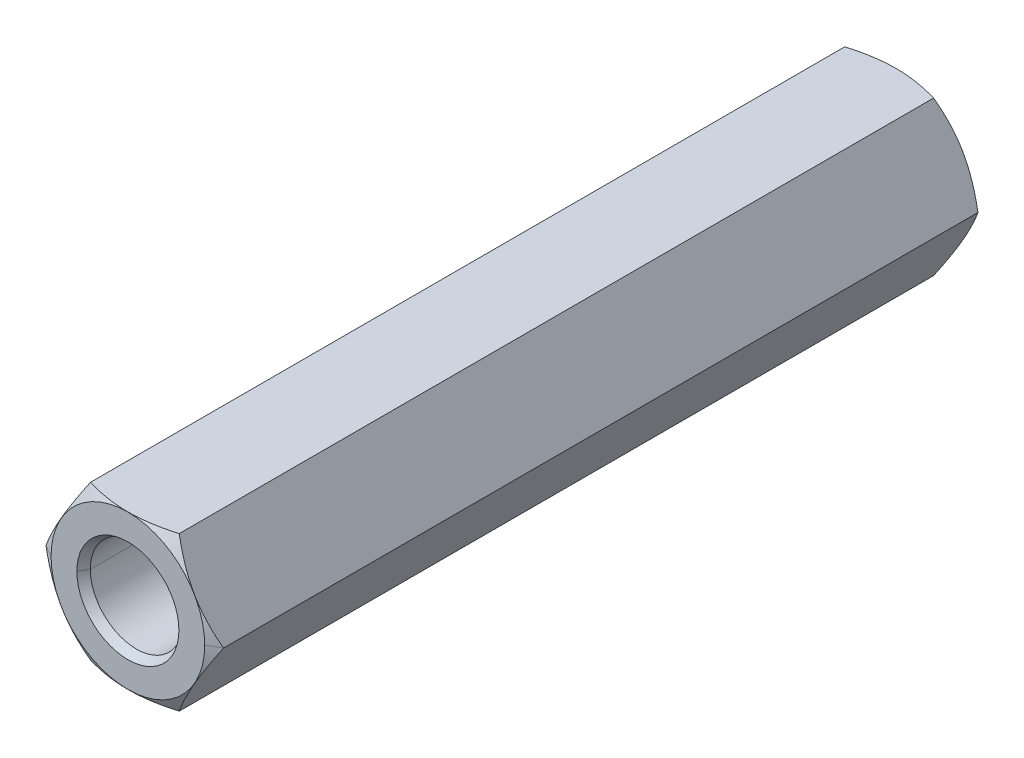
ISO-10303-21;
HEADER;
FILE_DESCRIPTION(('STEP AP214'),'2;1');
FILE_NAME('part.step','',(''),(''),'','','');
FILE_SCHEMA(('AUTOMOTIVE_DESIGN { 1 0 10303 214 1 1 1 1 }'));
ENDSEC;
DATA;
#1=APPLICATION_CONTEXT('core data for automotive mechanical design processes');
#2=APPLICATION_PROTOCOL_DEFINITION('international standard','automotive_design',2000,#1);
#3=PRODUCT_CONTEXT('',#1,'mechanical');
#4=PRODUCT('Part','Part','',(#3));
#5=PRODUCT_RELATED_PRODUCT_CATEGORY('part','',(#4));
#6=PRODUCT_DEFINITION_FORMATION('','',#4);
#7=PRODUCT_DEFINITION_CONTEXT('part definition',#1,'design');
#8=PRODUCT_DEFINITION('design','',#6,#7);
#9=PRODUCT_DEFINITION_SHAPE('','',#8);
#10=(LENGTH_UNIT() NAMED_UNIT(*) SI_UNIT(.MILLI.,.METRE.));
#11=(NAMED_UNIT(*) PLANE_ANGLE_UNIT() SI_UNIT($,.RADIAN.));
#12=(NAMED_UNIT(*) SI_UNIT($,.STERADIAN.) SOLID_ANGLE_UNIT());
#13=UNCERTAINTY_MEASURE_WITH_UNIT(LENGTH_MEASURE(1.E-05),#10,'distance_accuracy_value','');
#14=(GEOMETRIC_REPRESENTATION_CONTEXT(3) GLOBAL_UNCERTAINTY_ASSIGNED_CONTEXT((#13)) GLOBAL_UNIT_ASSIGNED_CONTEXT((#10,
#11,#12)) REPRESENTATION_CONTEXT('',''));
#15=CARTESIAN_POINT('',(0.,0.,0.));
#16=DIRECTION('',(0.,0.,1.));
#17=DIRECTION('',(1.,0.,0.));
#18=AXIS2_PLACEMENT_3D('',#15,#16,#17);
#19=CARTESIAN_POINT('',(220.318744279938,82.5620432923505,90.4476083123826));
#20=DIRECTION('',(0.,0.,-1.));
#21=DIRECTION('',(1.,0.,0.));
#22=AXIS2_PLACEMENT_3D('',#19,#20,#21);
#23=CONICAL_SURFACE('',#22,1.7320508075705,1.047197551197);
#24=DIRECTION('',(0.86602540378464,0.,-0.499999999999652));
#25=VECTOR('',#24,1.);
#26=CARTESIAN_POINT('',(222.050795087508,82.5620432923505,90.4476083123826));
#27=LINE('',#26,#25);
#28=CARTESIAN_POINT('',(220.318744279938,82.5620432923505,91.4476083123826));
#29=VERTEX_POINT('',#28);
#30=CARTESIAN_POINT('',(221.818744279938,82.5620432923505,90.5815829085986));
#31=VERTEX_POINT('',#30);
#32=EDGE_CURVE('E69',#29,#31,#27,.T.);
#33=ORIENTED_EDGE('',*,*,#32,.F.);
#34=DIRECTION('',(-0.86602540378464,0.,-0.499999999999652));
#35=VECTOR('',#34,1.);
#36=CARTESIAN_POINT('',(218.586693472367,82.5620432923505,90.4476083123826));
#37=LINE('',#36,#35);
#38=CARTESIAN_POINT('',(218.818744279938,82.5620432923505,90.5815829085986));
#39=VERTEX_POINT('',#38);
#40=EDGE_CURVE('E11',#29,#39,#37,.T.);
#41=ORIENTED_EDGE('',*,*,#40,.T.);
#42=CARTESIAN_POINT('',(220.318744279938,82.5620432923505,90.5815829085986));
#43=DIRECTION('',(0.,0.,1.));
#44=DIRECTION('',(1.,0.,0.));
#45=AXIS2_PLACEMENT_3D('',#42,#43,#44);
#46=CIRCLE('',#45,1.5);
#47=EDGE_CURVE('E57',#31,#39,#46,.T.);
#48=ORIENTED_EDGE('',*,*,#47,.F.);
#49=EDGE_LOOP('',(#33,#41,#48));
#50=FACE_BOUND('',#49,.T.);
#51=ADVANCED_FACE('F44',(#50),#23,.F.);
#52=CARTESIAN_POINT('',(220.318744279938,82.5620432923505,90.5815829085986));
#53=DIRECTION('',(0.,0.,-1.));
#54=DIRECTION('',(1.,0.,0.));
#55=AXIS2_PLACEMENT_3D('',#52,#53,#54);
#56=CYLINDRICAL_SURFACE('',#55,1.5);
#57=ORIENTED_EDGE('',*,*,#47,.T.);
#58=DIRECTION('',(0.,0.,-1.));
#59=VECTOR('',#58,1.);
#60=CARTESIAN_POINT('',(218.818744279938,82.5620432923505,90.5815829085986));
#61=LINE('',#60,#59);
#62=CARTESIAN_POINT('',(218.818744279938,82.5620432923505,80.8587110378087));
#63=VERTEX_POINT('',#62);
#64=EDGE_CURVE('E278',#39,#63,#61,.T.);
#65=ORIENTED_EDGE('',*,*,#64,.T.);
#66=CARTESIAN_POINT('',(220.318744279938,82.5620432923505,80.8587110378087));
#67=DIRECTION('',(0.,0.,1.));
#68=DIRECTION('',(1.,0.,0.));
#69=AXIS2_PLACEMENT_3D('',#66,#67,#68);
#70=CIRCLE('',#69,1.5);
#71=CARTESIAN_POINT('',(221.818744279938,82.5620432923505,80.8587110378087));
#72=VERTEX_POINT('',#71);
#73=EDGE_CURVE('E282',#72,#63,#70,.T.);
#74=ORIENTED_EDGE('',*,*,#73,.F.);
#75=DIRECTION('',(0.,0.,-1.));
#76=VECTOR('',#75,1.);
#77=CARTESIAN_POINT('',(221.818744279938,82.5620432923505,90.5815829085986));
#78=LINE('',#77,#76);
#79=EDGE_CURVE('E268',#31,#72,#78,.T.);
#80=ORIENTED_EDGE('',*,*,#79,.F.);
#81=EDGE_LOOP('',(#57,#65,#74,#80));
#82=FACE_BOUND('',#81,.T.);
#83=ADVANCED_FACE('F392',(#82),#56,.F.);
#84=CARTESIAN_POINT('',(220.318744279938,82.5620432923505,80.8587110378087));
#85=DIRECTION('',(0.,0.,-1.));
#86=DIRECTION('',(1.,0.,0.));
#87=AXIS2_PLACEMENT_3D('',#84,#85,#86);
#88=CONICAL_SURFACE('',#87,1.5,0.5235987756);
#89=ORIENTED_EDGE('',*,*,#73,.T.);
#90=DIRECTION('',(-0.500000000001473,0.,-0.866025403783588));
#91=VECTOR('',#90,1.);
#92=CARTESIAN_POINT('',(218.818744279938,82.5620432923505,80.8587110378087));
#93=LINE('',#92,#91);
#94=CARTESIAN_POINT('',(218.658744279937,82.5620432923505,80.5815829085986));
#95=VERTEX_POINT('',#94);
#96=EDGE_CURVE('E320',#63,#95,#93,.T.);
#97=ORIENTED_EDGE('',*,*,#96,.T.);
#98=CARTESIAN_POINT('',(220.318744279938,82.5620432923505,80.5815829085986));
#99=DIRECTION('',(0.,0.,1.));
#100=DIRECTION('',(1.,0.,0.));
#101=AXIS2_PLACEMENT_3D('',#98,#99,#100);
#102=CIRCLE('',#101,1.66);
#103=CARTESIAN_POINT('',(221.978744279938,82.5620432923505,80.5815829085986));
#104=VERTEX_POINT('',#103);
#105=EDGE_CURVE('E324',#104,#95,#102,.T.);
#106=ORIENTED_EDGE('',*,*,#105,.F.);
#107=DIRECTION('',(0.500000000001473,0.,-0.866025403783588));
#108=VECTOR('',#107,1.);
#109=CARTESIAN_POINT('',(221.818744279938,82.5620432923505,80.8587110378087));
#110=LINE('',#109,#108);
#111=EDGE_CURVE('E245',#72,#104,#110,.T.);
#112=ORIENTED_EDGE('',*,*,#111,.F.);
#113=EDGE_LOOP('',(#89,#97,#106,#112));
#114=FACE_BOUND('',#113,.T.);
#115=ADVANCED_FACE('F373',(#114),#88,.F.);
#116=CARTESIAN_POINT('',(220.318744279938,82.5620432923505,80.5815829085986));
#117=DIRECTION('',(0.,0.,1.));
#118=DIRECTION('',(1.,0.,0.));
#119=AXIS2_PLACEMENT_3D('',#116,#117,#118);
#120=CONICAL_SURFACE('',#119,2.5,1.047197551197);
#121=CARTESIAN_POINT('',(220.318744279938,82.5620432923505,80.5815829085986));
#122=DIRECTION('',(0.,0.,1.));
#123=DIRECTION('',(1.,0.,0.));
#124=AXIS2_PLACEMENT_3D('',#121,#122,#123);
#125=CIRCLE('',#124,2.5);
#126=CARTESIAN_POINT('',(222.818744279938,82.5620432923505,80.5815829085986));
#127=VERTEX_POINT('',#126);
#128=CARTESIAN_POINT('',(217.818744279938,82.5620432923505,80.5815829085986));
#129=VERTEX_POINT('',#128);
#130=EDGE_CURVE('E345',#127,#129,#125,.T.);
#131=ORIENTED_EDGE('',*,*,#130,.T.);
#132=DIRECTION('',(-0.86602540378464,0.,0.499999999999652));
#133=VECTOR('',#132,1.);
#134=CARTESIAN_POINT('',(217.818744279938,82.5620432923505,80.5815829085986));
#135=LINE('',#134,#133);
#136=CARTESIAN_POINT('',(217.428744279937,82.5620432923505,80.8067495135827));
#137=VERTEX_POINT('',#136);
#138=EDGE_CURVE('E217',#129,#137,#135,.T.);
#139=ORIENTED_EDGE('',*,*,#138,.T.);
#140=CARTESIAN_POINT('',(218.873744279938,85.0648567092876,80.8067495135827));
#141=CARTESIAN_POINT('',(218.151244279938,83.8134500008194,80.3896139440931));
#142=CARTESIAN_POINT('',(217.428744279937,82.5620432923505,80.8067495135827));
#143=(BOUNDED_CURVE() B_SPLINE_CURVE(2,(#140,#141,#142),.UNSPECIFIED.,.F.,
.F.) B_SPLINE_CURVE_WITH_KNOTS((3,3),(0.,1.),
.UNSPECIFIED.) CURVE() GEOMETRIC_REPRESENTATION_ITEM() RATIONAL_B_SPLINE_CURVE((1.,
1.15470053837935,1.)) REPRESENTATION_ITEM(''));
#144=CARTESIAN_POINT('',(218.873744279938,85.0648567092876,80.8067495135827));
#145=VERTEX_POINT('',#144);
#146=EDGE_CURVE('E200',#145,#137,#143,.T.);
#147=ORIENTED_EDGE('',*,*,#146,.F.);
#148=CARTESIAN_POINT('',(221.763744279937,85.0648567092876,80.8067495135827));
#149=CARTESIAN_POINT('',(220.318744279938,85.0648567092875,80.3896139440931));
#150=CARTESIAN_POINT('',(218.873744279938,85.0648567092876,80.8067495135827));
#151=(BOUNDED_CURVE() B_SPLINE_CURVE(2,(#148,#149,#150),.UNSPECIFIED.,.F.,
.F.) B_SPLINE_CURVE_WITH_KNOTS((3,3),(0.,1.),
.UNSPECIFIED.) CURVE() GEOMETRIC_REPRESENTATION_ITEM() RATIONAL_B_SPLINE_CURVE((1.,
1.15470053837926,1.)) REPRESENTATION_ITEM(''));
#152=CARTESIAN_POINT('',(221.763744279937,85.0648567092876,80.8067495135827));
#153=VERTEX_POINT('',#152);
#154=EDGE_CURVE('E293',#153,#145,#151,.T.);
#155=ORIENTED_EDGE('',*,*,#154,.F.);
#156=CARTESIAN_POINT('',(223.208744279937,82.5620432923505,80.8067495135827));
#157=CARTESIAN_POINT('',(222.486244279938,83.8134500008189,80.389613944093));
#158=CARTESIAN_POINT('',(221.763744279937,85.0648567092876,80.8067495135827));
#159=(BOUNDED_CURVE() B_SPLINE_CURVE(2,(#156,#157,#158),.UNSPECIFIED.,.F.,
.F.) B_SPLINE_CURVE_WITH_KNOTS((3,3),(0.,1.),
.UNSPECIFIED.) CURVE() GEOMETRIC_REPRESENTATION_ITEM() RATIONAL_B_SPLINE_CURVE((1.,
1.15470053837946,1.)) REPRESENTATION_ITEM(''));
#160=CARTESIAN_POINT('',(223.208744279937,82.5620432923505,80.8067495135827));
#161=VERTEX_POINT('',#160);
#162=EDGE_CURVE('E261',#161,#153,#159,.T.);
#163=ORIENTED_EDGE('',*,*,#162,.F.);
#164=DIRECTION('',(0.86602540378464,0.,0.499999999999652));
#165=VECTOR('',#164,1.);
#166=CARTESIAN_POINT('',(222.818744279938,82.5620432923505,80.5815829085986));
#167=LINE('',#166,#165);
#168=EDGE_CURVE('E302',#127,#161,#167,.T.);
#169=ORIENTED_EDGE('',*,*,#168,.F.);
#170=EDGE_LOOP('',(#131,#139,#147,#155,#163,#169));
#171=FACE_BOUND('',#170,.T.);
#172=ADVANCED_FACE('F412',(#171),#120,.T.);
#173=CARTESIAN_POINT('',(220.318744279938,82.5620432923505,105.356416303615));
#174=DIRECTION('',(0.,0.,-1.));
#175=DIRECTION('',(1.,0.,0.));
#176=AXIS2_PLACEMENT_3D('',#173,#174,#175);
#177=CONICAL_SURFACE('',#176,2.89,1.047197551197);
#178=CARTESIAN_POINT('',(220.318744279938,82.5620432923505,105.581582908599));
#179=DIRECTION('',(0.,0.,1.));
#180=DIRECTION('',(1.,0.,0.));
#181=AXIS2_PLACEMENT_3D('',#178,#179,#180);
#182=CIRCLE('',#181,2.5);
#183=CARTESIAN_POINT('',(217.818744279938,82.5620432923505,105.581582908599));
#184=VERTEX_POINT('',#183);
#185=CARTESIAN_POINT('',(222.818744279938,82.5620432923505,105.581582908599));
#186=VERTEX_POINT('',#185);
#187=EDGE_CURVE('E215',#184,#186,#182,.T.);
#188=ORIENTED_EDGE('',*,*,#187,.F.);
#189=DIRECTION('',(-0.86602540378464,0.,-0.499999999999652));
#190=VECTOR('',#189,1.);
#191=CARTESIAN_POINT('',(217.428744279937,82.5620432923505,105.356416303615));
#192=LINE('',#191,#190);
#193=CARTESIAN_POINT('',(217.428744279937,82.5620432923506,105.356416303615));
#194=VERTEX_POINT('',#193);
#195=EDGE_CURVE('E192',#184,#194,#192,.T.);
#196=ORIENTED_EDGE('',*,*,#195,.T.);
#197=CARTESIAN_POINT('',(218.873744279938,80.0592298754135,105.356416303615));
#198=CARTESIAN_POINT('',(218.151244279938,81.3106365838816,105.773551873104));
#199=CARTESIAN_POINT('',(217.428744279937,82.5620432923506,105.356416303615));
#200=(BOUNDED_CURVE() B_SPLINE_CURVE(2,(#197,#198,#199),.UNSPECIFIED.,.F.,
.F.) B_SPLINE_CURVE_WITH_KNOTS((3,3),(0.,1.),
.UNSPECIFIED.) CURVE() GEOMETRIC_REPRESENTATION_ITEM() RATIONAL_B_SPLINE_CURVE((1.,
1.15470053837936,1.)) REPRESENTATION_ITEM(''));
#201=CARTESIAN_POINT('',(218.873744279938,80.0592298754135,105.356416303615));
#202=VERTEX_POINT('',#201);
#203=EDGE_CURVE('E48',#202,#194,#200,.T.);
#204=ORIENTED_EDGE('',*,*,#203,.F.);
#205=CARTESIAN_POINT('',(221.763744279937,80.0592298754135,105.356416303615));
#206=CARTESIAN_POINT('',(220.318744279938,80.0592298754135,105.773551873104));
#207=CARTESIAN_POINT('',(218.873744279938,80.0592298754135,105.356416303615));
#208=(BOUNDED_CURVE() B_SPLINE_CURVE(2,(#205,#206,#207),.UNSPECIFIED.,.F.,
.F.) B_SPLINE_CURVE_WITH_KNOTS((3,3),(0.,1.),
.UNSPECIFIED.) CURVE() GEOMETRIC_REPRESENTATION_ITEM() RATIONAL_B_SPLINE_CURVE((1.,
1.15470053837925,1.)) REPRESENTATION_ITEM(''));
#209=CARTESIAN_POINT('',(221.763744279937,80.0592298754135,105.356416303615));
#210=VERTEX_POINT('',#209);
#211=EDGE_CURVE('E308',#210,#202,#208,.T.);
#212=ORIENTED_EDGE('',*,*,#211,.F.);
#213=CARTESIAN_POINT('',(223.208744279937,82.5620432923505,105.356416303615));
#214=CARTESIAN_POINT('',(222.486244279938,81.3106365838822,105.773551873104));
#215=CARTESIAN_POINT('',(221.763744279937,80.0592298754135,105.356416303615));
#216=(BOUNDED_CURVE() B_SPLINE_CURVE(2,(#213,#214,#215),.UNSPECIFIED.,.F.,
.F.) B_SPLINE_CURVE_WITH_KNOTS((3,3),(0.,1.),
.UNSPECIFIED.) CURVE() GEOMETRIC_REPRESENTATION_ITEM() RATIONAL_B_SPLINE_CURVE((1.,
1.15470053837944,1.)) REPRESENTATION_ITEM(''));
#217=CARTESIAN_POINT('',(223.208744279937,82.5620432923505,105.356416303615));
#218=VERTEX_POINT('',#217);
#219=EDGE_CURVE('E339',#218,#210,#216,.T.);
#220=ORIENTED_EDGE('',*,*,#219,.F.);
#221=DIRECTION('',(0.86602540378464,0.,-0.499999999999652));
#222=VECTOR('',#221,1.);
#223=CARTESIAN_POINT('',(223.208744279937,82.5620432923505,105.356416303615));
#224=LINE('',#223,#222);
#225=EDGE_CURVE('E249',#186,#218,#224,.T.);
#226=ORIENTED_EDGE('',*,*,#225,.F.);
#227=EDGE_LOOP('',(#188,#196,#204,#212,#220,#226));
#228=FACE_BOUND('',#227,.T.);
#229=ADVANCED_FACE('F213',(#228),#177,.T.);
#230=CARTESIAN_POINT('',(220.318744279938,82.5620432923505,105.581582908599));
#231=DIRECTION('',(0.,0.,1.));
#232=DIRECTION('',(1.,0.,0.));
#233=AXIS2_PLACEMENT_3D('',#230,#231,#232);
#234=CONICAL_SURFACE('',#233,1.65999999999899,0.523598775598);
#235=CARTESIAN_POINT('',(220.318744279938,82.5620432923505,105.304454779389));
#236=DIRECTION('',(0.,0.,1.));
#237=DIRECTION('',(1.,0.,0.));
#238=AXIS2_PLACEMENT_3D('',#235,#236,#237);
#239=CIRCLE('',#238,1.5);
#240=CARTESIAN_POINT('',(218.818744279938,82.5620432923505,105.304454779389));
#241=VERTEX_POINT('',#240);
#242=CARTESIAN_POINT('',(221.818744279938,82.5620432923505,105.304454779389));
#243=VERTEX_POINT('',#242);
#244=EDGE_CURVE('E250',#241,#243,#239,.T.);
#245=ORIENTED_EDGE('',*,*,#244,.F.);
#246=DIRECTION('',(-0.499999999999741,0.,0.866025403784588));
#247=VECTOR('',#246,1.);
#248=CARTESIAN_POINT('',(218.658744279938,82.5620432923505,105.581582908599));
#249=LINE('',#248,#247);
#250=CARTESIAN_POINT('',(218.658744279938,82.5620432923505,105.581582908599));
#251=VERTEX_POINT('',#250);
#252=EDGE_CURVE('E218',#241,#251,#249,.T.);
#253=ORIENTED_EDGE('',*,*,#252,.T.);
#254=CARTESIAN_POINT('',(220.318744279938,82.5620432923505,105.581582908599));
#255=DIRECTION('',(0.,0.,1.));
#256=DIRECTION('',(1.,0.,0.));
#257=AXIS2_PLACEMENT_3D('',#254,#255,#256);
#258=CIRCLE('',#257,1.65999999999899);
#259=CARTESIAN_POINT('',(221.978744279937,82.5620432923505,105.581582908599));
#260=VERTEX_POINT('',#259);
#261=EDGE_CURVE('E496',#251,#260,#258,.T.);
#262=ORIENTED_EDGE('',*,*,#261,.T.);
#263=DIRECTION('',(0.499999999999741,0.,0.866025403784588));
#264=VECTOR('',#263,1.);
#265=CARTESIAN_POINT('',(221.978744279937,82.5620432923505,105.581582908599));
#266=LINE('',#265,#264);
#267=EDGE_CURVE('E294',#243,#260,#266,.T.);
#268=ORIENTED_EDGE('',*,*,#267,.F.);
#269=EDGE_LOOP('',(#245,#253,#262,#268));
#270=FACE_BOUND('',#269,.T.);
#271=ADVANCED_FACE('F411',(#270),#234,.F.);
#272=CARTESIAN_POINT('',(220.318744279938,82.5620432923505,105.304454779389));
#273=DIRECTION('',(0.,0.,-1.));
#274=DIRECTION('',(1.,0.,0.));
#275=AXIS2_PLACEMENT_3D('',#272,#273,#274);
#276=CYLINDRICAL_SURFACE('',#275,1.5);
#277=CARTESIAN_POINT('',(220.318744279938,82.5620432923505,105.304454779389));
#278=DIRECTION('',(0.,0.,1.));
#279=DIRECTION('',(1.,0.,0.));
#280=AXIS2_PLACEMENT_3D('',#277,#278,#279);
#281=CIRCLE('',#280,1.5);
#282=EDGE_CURVE('E503',#243,#241,#281,.T.);
#283=ORIENTED_EDGE('',*,*,#282,.T.);
#284=DIRECTION('',(0.,0.,-1.));
#285=VECTOR('',#284,1.);
#286=CARTESIAN_POINT('',(218.818744279938,82.5620432923505,105.304454779389));
#287=LINE('',#286,#285);
#288=CARTESIAN_POINT('',(218.818744279938,82.5620432923505,95.5815829085986));
#289=VERTEX_POINT('',#288);
#290=EDGE_CURVE('E286',#241,#289,#287,.T.);
#291=ORIENTED_EDGE('',*,*,#290,.T.);
#292=CARTESIAN_POINT('',(220.318744279938,82.5620432923505,95.5815829085986));
#293=DIRECTION('',(0.,0.,1.));
#294=DIRECTION('',(1.,0.,0.));
#295=AXIS2_PLACEMENT_3D('',#292,#293,#294);
#296=CIRCLE('',#295,1.5);
#297=CARTESIAN_POINT('',(221.818744279938,82.5620432923505,95.5815829085986));
#298=VERTEX_POINT('',#297);
#299=EDGE_CURVE('E254',#298,#289,#296,.T.);
#300=ORIENTED_EDGE('',*,*,#299,.F.);
#301=DIRECTION('',(0.,0.,-1.));
#302=VECTOR('',#301,1.);
#303=CARTESIAN_POINT('',(221.818744279938,82.5620432923505,105.304454779389));
#304=LINE('',#303,#302);
#305=EDGE_CURVE('E231',#243,#298,#304,.T.);
#306=ORIENTED_EDGE('',*,*,#305,.F.);
#307=EDGE_LOOP('',(#283,#291,#300,#306));
#308=FACE_BOUND('',#307,.T.);
#309=ADVANCED_FACE('F417',(#308),#276,.F.);
#310=CARTESIAN_POINT('',(220.318744279938,82.5620432923505,95.5815829085986));
#311=DIRECTION('',(0.,0.,1.));
#312=DIRECTION('',(1.,0.,0.));
#313=AXIS2_PLACEMENT_3D('',#310,#311,#312);
#314=CONICAL_SURFACE('',#313,1.5,1.047197551197);
#315=DIRECTION('',(0.86602540378464,0.,0.499999999999652));
#316=VECTOR('',#315,1.);
#317=CARTESIAN_POINT('',(221.818744279938,82.5620432923505,95.5815829085986));
#318=LINE('',#317,#316);
#319=CARTESIAN_POINT('',(220.318744279938,82.5620432923505,94.7155575048136));
#320=VERTEX_POINT('',#319);
#321=EDGE_CURVE('E260',#320,#298,#318,.T.);
#322=ORIENTED_EDGE('',*,*,#321,.F.);
#323=DIRECTION('',(-0.86602540378464,0.,0.499999999999652));
#324=VECTOR('',#323,1.);
#325=CARTESIAN_POINT('',(218.818744279938,82.5620432923505,95.5815829085986));
#326=LINE('',#325,#324);
#327=EDGE_CURVE('E259',#320,#289,#326,.T.);
#328=ORIENTED_EDGE('',*,*,#327,.T.);
#329=CARTESIAN_POINT('',(220.318744279938,82.5620432923505,95.5815829085986));
#330=DIRECTION('',(0.,0.,1.));
#331=DIRECTION('',(1.,0.,0.));
#332=AXIS2_PLACEMENT_3D('',#329,#330,#331);
#333=CIRCLE('',#332,1.5);
#334=EDGE_CURVE('E255',#289,#298,#333,.T.);
#335=ORIENTED_EDGE('',*,*,#334,.T.);
#336=EDGE_LOOP('',(#322,#328,#335));
#337=FACE_BOUND('',#336,.T.);
#338=ADVANCED_FACE('F451',(#337),#314,.F.);
#339=CARTESIAN_POINT('',(220.318744279938,82.5620432923505,95.5815829085986));
#340=DIRECTION('',(0.,0.,1.));
#341=DIRECTION('',(1.,0.,0.));
#342=AXIS2_PLACEMENT_3D('',#339,#340,#341);
#343=CONICAL_SURFACE('',#342,1.5,1.047197551197);
#344=ORIENTED_EDGE('',*,*,#327,.F.);
#345=ORIENTED_EDGE('',*,*,#321,.T.);
#346=ORIENTED_EDGE('',*,*,#299,.T.);
#347=EDGE_LOOP('',(#344,#345,#346));
#348=FACE_BOUND('',#347,.T.);
#349=ADVANCED_FACE('F427',(#348),#343,.F.);
#350=CARTESIAN_POINT('',(220.318744279938,82.5620432923505,105.304454779389));
#351=DIRECTION('',(0.,0.,-1.));
#352=DIRECTION('',(1.,0.,0.));
#353=AXIS2_PLACEMENT_3D('',#350,#351,#352);
#354=CYLINDRICAL_SURFACE('',#353,1.5);
#355=ORIENTED_EDGE('',*,*,#290,.F.);
#356=ORIENTED_EDGE('',*,*,#244,.T.);
#357=ORIENTED_EDGE('',*,*,#305,.T.);
#358=ORIENTED_EDGE('',*,*,#334,.F.);
#359=EDGE_LOOP('',(#355,#356,#357,#358));
#360=FACE_BOUND('',#359,.T.);
#361=ADVANCED_FACE('F455',(#360),#354,.F.);
#362=CARTESIAN_POINT('',(220.318744279938,82.5620432923505,105.581582908599));
#363=DIRECTION('',(0.,0.,1.));
#364=DIRECTION('',(1.,0.,0.));
#365=AXIS2_PLACEMENT_3D('',#362,#363,#364);
#366=CONICAL_SURFACE('',#365,1.65999999999899,0.523598775598);
#367=ORIENTED_EDGE('',*,*,#252,.F.);
#368=ORIENTED_EDGE('',*,*,#282,.F.);
#369=ORIENTED_EDGE('',*,*,#267,.T.);
#370=CARTESIAN_POINT('',(220.318744279938,82.5620432923505,105.581582908599));
#371=DIRECTION('',(0.,0.,1.));
#372=DIRECTION('',(1.,0.,0.));
#373=AXIS2_PLACEMENT_3D('',#370,#371,#372);
#374=CIRCLE('',#373,1.65999999999899);
#375=EDGE_CURVE('E298',#260,#251,#374,.T.);
#376=ORIENTED_EDGE('',*,*,#375,.T.);
#377=EDGE_LOOP('',(#367,#368,#369,#376));
#378=FACE_BOUND('',#377,.T.);
#379=ADVANCED_FACE('F458',(#378),#366,.F.);
#380=CARTESIAN_POINT('',(220.318744279938,82.5620432923505,105.581582908599));
#381=DIRECTION('',(0.,0.,1.));
#382=DIRECTION('',(1.,0.,0.));
#383=AXIS2_PLACEMENT_3D('',#380,#381,#382);
#384=PLANE('',#383);
#385=CARTESIAN_POINT('',(220.318744279938,82.5620432923505,105.581582908599));
#386=DIRECTION('',(0.,0.,1.));
#387=DIRECTION('',(1.,0.,0.));
#388=AXIS2_PLACEMENT_3D('',#385,#386,#387);
#389=CIRCLE('',#388,2.5);
#390=EDGE_CURVE('E248',#186,#184,#389,.T.);
#391=ORIENTED_EDGE('',*,*,#390,.T.);
#392=ORIENTED_EDGE('',*,*,#187,.T.);
#393=EDGE_LOOP('',(#391,#392));
#394=FACE_BOUND('',#393,.T.);
#395=ORIENTED_EDGE('',*,*,#375,.F.);
#396=ORIENTED_EDGE('',*,*,#261,.F.);
#397=EDGE_LOOP('',(#395,#396));
#398=FACE_BOUND('',#397,.T.);
#399=ADVANCED_FACE('F433',(#394,#398),#384,.T.);
#400=CARTESIAN_POINT('',(220.318744279938,82.5620432923505,105.356416303615));
#401=DIRECTION('',(0.,0.,-1.));
#402=DIRECTION('',(1.,0.,0.));
#403=AXIS2_PLACEMENT_3D('',#400,#401,#402);
#404=CONICAL_SURFACE('',#403,2.89,1.047197551197);
#405=ORIENTED_EDGE('',*,*,#195,.F.);
#406=ORIENTED_EDGE('',*,*,#390,.F.);
#407=ORIENTED_EDGE('',*,*,#225,.T.);
#408=CARTESIAN_POINT('',(221.763744279937,85.0648567092876,105.356416303615));
#409=CARTESIAN_POINT('',(222.486244279938,83.8134500008194,105.773551873104));
#410=CARTESIAN_POINT('',(223.208744279937,82.5620432923505,105.356416303615));
#411=(BOUNDED_CURVE() B_SPLINE_CURVE(2,(#408,#409,#410),.UNSPECIFIED.,.F.,
.F.) B_SPLINE_CURVE_WITH_KNOTS((3,3),(0.,1.),
.UNSPECIFIED.) CURVE() GEOMETRIC_REPRESENTATION_ITEM() RATIONAL_B_SPLINE_CURVE((1.,
1.15470053837935,1.)) REPRESENTATION_ITEM(''));
#412=CARTESIAN_POINT('',(221.763744279937,85.0648567092876,105.356416303615));
#413=VERTEX_POINT('',#412);
#414=EDGE_CURVE('E126',#413,#218,#411,.T.);
#415=ORIENTED_EDGE('',*,*,#414,.F.);
#416=CARTESIAN_POINT('',(218.873744279938,85.0648567092876,105.356416303615));
#417=CARTESIAN_POINT('',(220.318744279937,85.0648567092875,105.773551873104));
#418=CARTESIAN_POINT('',(221.763744279937,85.0648567092876,105.356416303615));
#419=(BOUNDED_CURVE() B_SPLINE_CURVE(2,(#416,#417,#418),.UNSPECIFIED.,.F.,
.F.) B_SPLINE_CURVE_WITH_KNOTS((3,3),(0.,1.),
.UNSPECIFIED.) CURVE() GEOMETRIC_REPRESENTATION_ITEM() RATIONAL_B_SPLINE_CURVE((1.,
1.15470053837925,1.)) REPRESENTATION_ITEM(''));
#420=CARTESIAN_POINT('',(218.873744279938,85.0648567092876,105.356416303615));
#421=VERTEX_POINT('',#420);
#422=EDGE_CURVE('E137',#421,#413,#419,.T.);
#423=ORIENTED_EDGE('',*,*,#422,.F.);
#424=CARTESIAN_POINT('',(217.428744279937,82.5620432923506,105.356416303615));
#425=CARTESIAN_POINT('',(218.151244279937,83.8134500008189,105.773551873104));
#426=CARTESIAN_POINT('',(218.873744279938,85.0648567092876,105.356416303615));
#427=(BOUNDED_CURVE() B_SPLINE_CURVE(2,(#424,#425,#426),.UNSPECIFIED.,.F.,
.F.) B_SPLINE_CURVE_WITH_KNOTS((3,3),(0.,1.),
.UNSPECIFIED.) CURVE() GEOMETRIC_REPRESENTATION_ITEM() RATIONAL_B_SPLINE_CURVE((1.,
1.15470053837944,1.)) REPRESENTATION_ITEM(''));
#428=EDGE_CURVE('E187',#194,#421,#427,.T.);
#429=ORIENTED_EDGE('',*,*,#428,.F.);
#430=EDGE_LOOP('',(#405,#406,#407,#415,#423,#429));
#431=FACE_BOUND('',#430,.T.);
#432=ADVANCED_FACE('F189',(#431),#404,.T.);
#433=CARTESIAN_POINT('',(221.763744279937,80.0592298754135,80.5815829085986));
#434=DIRECTION('',(-0.866025403784329,0.50000000000019,0.));
#435=DIRECTION('',(0.,0.,1.));
#436=AXIS2_PLACEMENT_3D('',#433,#434,#435);
#437=PLANE('',#436);
#438=DIRECTION('',(0.,0.,1.));
#439=VECTOR('',#438,1.);
#440=CARTESIAN_POINT('',(223.208744279937,82.5620432923505,80.8067495135827));
#441=LINE('',#440,#439);
#442=EDGE_CURVE('E359',#161,#218,#441,.T.);
#443=ORIENTED_EDGE('',*,*,#442,.T.);
#444=ORIENTED_EDGE('',*,*,#219,.T.);
#445=DIRECTION('',(0.,0.,1.));
#446=VECTOR('',#445,1.);
#447=CARTESIAN_POINT('',(221.763744279937,80.0592298754135,80.5815829085986));
#448=LINE('',#447,#446);
#449=CARTESIAN_POINT('',(221.763744279937,80.0592298754135,80.8067495135827));
#450=VERTEX_POINT('',#449);
#451=EDGE_CURVE('E303',#450,#210,#448,.T.);
#452=ORIENTED_EDGE('',*,*,#451,.F.);
#453=CARTESIAN_POINT('',(221.763744279937,80.0592298754135,80.8067495135827));
#454=CARTESIAN_POINT('',(222.486244279938,81.3106365838817,80.389613944093));
#455=CARTESIAN_POINT('',(223.208744279937,82.5620432923505,80.8067495135827));
#456=(BOUNDED_CURVE() B_SPLINE_CURVE(2,(#453,#454,#455),.UNSPECIFIED.,.F.,
.F.) B_SPLINE_CURVE_WITH_KNOTS((3,3),(0.,1.),
.UNSPECIFIED.) CURVE() GEOMETRIC_REPRESENTATION_ITEM() RATIONAL_B_SPLINE_CURVE((1.,
1.15470053837935,1.)) REPRESENTATION_ITEM(''));
#457=EDGE_CURVE('E307',#450,#161,#456,.T.);
#458=ORIENTED_EDGE('',*,*,#457,.T.);
#459=EDGE_LOOP('',(#443,#444,#452,#458));
#460=FACE_BOUND('',#459,.T.);
#461=ADVANCED_FACE('F432',(#460),#437,.F.);
#462=CARTESIAN_POINT('',(218.873744279938,80.0592298754135,80.5815829085986));
#463=DIRECTION('',(0.,1.,0.));
#464=DIRECTION('',(1.,0.,0.));
#465=AXIS2_PLACEMENT_3D('',#462,#463,#464);
#466=PLANE('',#465);
#467=ORIENTED_EDGE('',*,*,#451,.T.);
#468=ORIENTED_EDGE('',*,*,#211,.T.);
#469=DIRECTION('',(0.,0.,1.));
#470=VECTOR('',#469,1.);
#471=CARTESIAN_POINT('',(218.873744279938,80.0592298754135,80.5815829085986));
#472=LINE('',#471,#470);
#473=CARTESIAN_POINT('',(218.873744279938,80.0592298754135,80.8067495135827));
#474=VERTEX_POINT('',#473);
#475=EDGE_CURVE('E208',#474,#202,#472,.T.);
#476=ORIENTED_EDGE('',*,*,#475,.F.);
#477=CARTESIAN_POINT('',(218.873744279938,80.0592298754135,80.8067495135827));
#478=CARTESIAN_POINT('',(220.318744279938,80.0592298754135,80.3896139440931));
#479=CARTESIAN_POINT('',(221.763744279937,80.0592298754135,80.8067495135827));
#480=(BOUNDED_CURVE() B_SPLINE_CURVE(2,(#477,#478,#479),.UNSPECIFIED.,.F.,
.F.) B_SPLINE_CURVE_WITH_KNOTS((3,3),(0.,1.),
.UNSPECIFIED.) CURVE() GEOMETRIC_REPRESENTATION_ITEM() RATIONAL_B_SPLINE_CURVE((1.,
1.15470053837926,1.)) REPRESENTATION_ITEM(''));
#481=EDGE_CURVE('E313',#474,#450,#480,.T.);
#482=ORIENTED_EDGE('',*,*,#481,.T.);
#483=EDGE_LOOP('',(#467,#468,#476,#482));
#484=FACE_BOUND('',#483,.T.);
#485=ADVANCED_FACE('F436',(#484),#466,.F.);
#486=CARTESIAN_POINT('',(217.428744279937,82.5620432923505,80.5815829085986));
#487=DIRECTION('',(0.866025403784329,0.50000000000019,0.));
#488=DIRECTION('',(0.,0.,-1.));
#489=AXIS2_PLACEMENT_3D('',#486,#487,#488);
#490=PLANE('',#489);
#491=ORIENTED_EDGE('',*,*,#475,.T.);
#492=ORIENTED_EDGE('',*,*,#203,.T.);
#493=DIRECTION('',(0.,0.,1.));
#494=VECTOR('',#493,1.);
#495=CARTESIAN_POINT('',(217.428744279937,82.5620432923505,80.5815829085986));
#496=LINE('',#495,#494);
#497=EDGE_CURVE('E199',#137,#194,#496,.T.);
#498=ORIENTED_EDGE('',*,*,#497,.F.);
#499=CARTESIAN_POINT('',(217.428744279937,82.5620432923505,80.8067495135827));
#500=CARTESIAN_POINT('',(218.151244279937,81.3106365838822,80.3896139440929));
#501=CARTESIAN_POINT('',(218.873744279938,80.0592298754135,80.8067495135827));
#502=(BOUNDED_CURVE() B_SPLINE_CURVE(2,(#499,#500,#501),.UNSPECIFIED.,.F.,
.F.) B_SPLINE_CURVE_WITH_KNOTS((3,3),(0.,1.),
.UNSPECIFIED.) CURVE() GEOMETRIC_REPRESENTATION_ITEM() RATIONAL_B_SPLINE_CURVE((1.,
1.15470053837945,1.)) REPRESENTATION_ITEM(''));
#503=EDGE_CURVE('E212',#137,#474,#502,.T.);
#504=ORIENTED_EDGE('',*,*,#503,.T.);
#505=EDGE_LOOP('',(#491,#492,#498,#504));
#506=FACE_BOUND('',#505,.T.);
#507=ADVANCED_FACE('F205',(#506),#490,.F.);
#508=CARTESIAN_POINT('',(218.873744279938,85.0648567092876,80.5815829085986));
#509=DIRECTION('',(0.866025403784329,-0.50000000000019,0.));
#510=DIRECTION('',(0.,0.,-1.));
#511=AXIS2_PLACEMENT_3D('',#508,#509,#510);
#512=PLANE('',#511);
#513=ORIENTED_EDGE('',*,*,#497,.T.);
#514=ORIENTED_EDGE('',*,*,#428,.T.);
#515=DIRECTION('',(0.,0.,1.));
#516=VECTOR('',#515,1.);
#517=CARTESIAN_POINT('',(218.873744279938,85.0648567092876,80.5815829085986));
#518=LINE('',#517,#516);
#519=EDGE_CURVE('E236',#145,#421,#518,.T.);
#520=ORIENTED_EDGE('',*,*,#519,.F.);
#521=ORIENTED_EDGE('',*,*,#146,.T.);
#522=EDGE_LOOP('',(#513,#514,#520,#521));
#523=FACE_BOUND('',#522,.T.);
#524=ADVANCED_FACE('F220',(#523),#512,.F.);
#525=CARTESIAN_POINT('',(221.763744279937,85.0648567092876,80.5815829085986));
#526=DIRECTION('',(0.,-1.,0.));
#527=DIRECTION('',(-1.,0.,0.));
#528=AXIS2_PLACEMENT_3D('',#525,#526,#527);
#529=PLANE('',#528);
#530=ORIENTED_EDGE('',*,*,#519,.T.);
#531=ORIENTED_EDGE('',*,*,#422,.T.);
#532=DIRECTION('',(0.,0.,1.));
#533=VECTOR('',#532,1.);
#534=CARTESIAN_POINT('',(221.763744279937,85.0648567092876,80.5815829085986));
#535=LINE('',#534,#533);
#536=EDGE_CURVE('E289',#153,#413,#535,.T.);
#537=ORIENTED_EDGE('',*,*,#536,.F.);
#538=ORIENTED_EDGE('',*,*,#154,.T.);
#539=EDGE_LOOP('',(#530,#531,#537,#538));
#540=FACE_BOUND('',#539,.T.);
#541=ADVANCED_FACE('F450',(#540),#529,.F.);
#542=CARTESIAN_POINT('',(223.208744279937,82.5620432923505,80.5815829085986));
#543=DIRECTION('',(-0.866025403784329,-0.50000000000019,0.));
#544=DIRECTION('',(-0.50000000000019,0.866025403784329,0.));
#545=AXIS2_PLACEMENT_3D('',#542,#543,#544);
#546=PLANE('',#545);
#547=ORIENTED_EDGE('',*,*,#536,.T.);
#548=ORIENTED_EDGE('',*,*,#414,.T.);
#549=ORIENTED_EDGE('',*,*,#442,.F.);
#550=ORIENTED_EDGE('',*,*,#162,.T.);
#551=EDGE_LOOP('',(#547,#548,#549,#550));
#552=FACE_BOUND('',#551,.T.);
#553=ADVANCED_FACE('F446',(#552),#546,.F.);
#554=CARTESIAN_POINT('',(220.318744279938,82.5620432923505,80.5815829085986));
#555=DIRECTION('',(0.,0.,1.));
#556=DIRECTION('',(1.,0.,0.));
#557=AXIS2_PLACEMENT_3D('',#554,#555,#556);
#558=CONICAL_SURFACE('',#557,2.5,1.047197551197);
#559=ORIENTED_EDGE('',*,*,#138,.F.);
#560=CARTESIAN_POINT('',(220.318744279938,82.5620432923505,80.5815829085986));
#561=DIRECTION('',(0.,0.,1.));
#562=DIRECTION('',(1.,0.,0.));
#563=AXIS2_PLACEMENT_3D('',#560,#561,#562);
#564=CIRCLE('',#563,2.5);
#565=EDGE_CURVE('E267',#129,#127,#564,.T.);
#566=ORIENTED_EDGE('',*,*,#565,.T.);
#567=ORIENTED_EDGE('',*,*,#168,.T.);
#568=ORIENTED_EDGE('',*,*,#457,.F.);
#569=ORIENTED_EDGE('',*,*,#481,.F.);
#570=ORIENTED_EDGE('',*,*,#503,.F.);
#571=EDGE_LOOP('',(#559,#566,#567,#568,#569,#570));
#572=FACE_BOUND('',#571,.T.);
#573=ADVANCED_FACE('F443',(#572),#558,.T.);
#574=CARTESIAN_POINT('',(220.318744279938,82.5620432923505,80.5815829085986));
#575=DIRECTION('',(0.,0.,1.));
#576=DIRECTION('',(1.,0.,0.));
#577=AXIS2_PLACEMENT_3D('',#574,#575,#576);
#578=PLANE('',#577);
#579=ORIENTED_EDGE('',*,*,#130,.F.);
#580=ORIENTED_EDGE('',*,*,#565,.F.);
#581=EDGE_LOOP('',(#579,#580));
#582=FACE_BOUND('',#581,.T.);
#583=ORIENTED_EDGE('',*,*,#105,.T.);
#584=CARTESIAN_POINT('',(220.318744279938,82.5620432923505,80.5815829085986));
#585=DIRECTION('',(0.,0.,1.));
#586=DIRECTION('',(1.,0.,0.));
#587=AXIS2_PLACEMENT_3D('',#584,#585,#586);
#588=CIRCLE('',#587,1.66);
#589=EDGE_CURVE('E244',#95,#104,#588,.T.);
#590=ORIENTED_EDGE('',*,*,#589,.T.);
#591=EDGE_LOOP('',(#583,#590));
#592=FACE_BOUND('',#591,.T.);
#593=ADVANCED_FACE('F46',(#582,#592),#578,.F.);
#594=CARTESIAN_POINT('',(220.318744279938,82.5620432923505,80.8587110378087));
#595=DIRECTION('',(0.,0.,-1.));
#596=DIRECTION('',(1.,0.,0.));
#597=AXIS2_PLACEMENT_3D('',#594,#595,#596);
#598=CONICAL_SURFACE('',#597,1.5,0.5235987756);
#599=ORIENTED_EDGE('',*,*,#96,.F.);
#600=CARTESIAN_POINT('',(220.318744279938,82.5620432923505,80.8587110378087));
#601=DIRECTION('',(0.,0.,1.));
#602=DIRECTION('',(1.,0.,0.));
#603=AXIS2_PLACEMENT_3D('',#600,#601,#602);
#604=CIRCLE('',#603,1.5);
#605=EDGE_CURVE('E237',#63,#72,#604,.T.);
#606=ORIENTED_EDGE('',*,*,#605,.T.);
#607=ORIENTED_EDGE('',*,*,#111,.T.);
#608=ORIENTED_EDGE('',*,*,#589,.F.);
#609=EDGE_LOOP('',(#599,#606,#607,#608));
#610=FACE_BOUND('',#609,.T.);
#611=ADVANCED_FACE('F368',(#610),#598,.F.);
#612=CARTESIAN_POINT('',(220.318744279938,82.5620432923505,90.5815829085986));
#613=DIRECTION('',(0.,0.,-1.));
#614=DIRECTION('',(1.,0.,0.));
#615=AXIS2_PLACEMENT_3D('',#612,#613,#614);
#616=CYLINDRICAL_SURFACE('',#615,1.5);
#617=ORIENTED_EDGE('',*,*,#64,.F.);
#618=CARTESIAN_POINT('',(220.318744279938,82.5620432923505,90.5815829085986));
#619=DIRECTION('',(0.,0.,1.));
#620=DIRECTION('',(1.,0.,0.));
#621=AXIS2_PLACEMENT_3D('',#618,#619,#620);
#622=CIRCLE('',#621,1.5);
#623=EDGE_CURVE('E274',#39,#31,#622,.T.);
#624=ORIENTED_EDGE('',*,*,#623,.T.);
#625=ORIENTED_EDGE('',*,*,#79,.T.);
#626=ORIENTED_EDGE('',*,*,#605,.F.);
#627=EDGE_LOOP('',(#617,#624,#625,#626));
#628=FACE_BOUND('',#627,.T.);
#629=ADVANCED_FACE('F394',(#628),#616,.F.);
#630=CARTESIAN_POINT('',(220.318744279938,82.5620432923505,90.4476083123826));
#631=DIRECTION('',(0.,0.,-1.));
#632=DIRECTION('',(1.,0.,0.));
#633=AXIS2_PLACEMENT_3D('',#630,#631,#632);
#634=CONICAL_SURFACE('',#633,1.7320508075705,1.047197551197);
#635=ORIENTED_EDGE('',*,*,#40,.F.);
#636=ORIENTED_EDGE('',*,*,#32,.T.);
#637=ORIENTED_EDGE('',*,*,#623,.F.);
#638=EDGE_LOOP('',(#635,#636,#637));
#639=FACE_BOUND('',#638,.T.);
#640=ADVANCED_FACE('F390',(#639),#634,.F.);
#641=CLOSED_SHELL('',(#51,#83,#115,#172,#229,#271,#309,#338,#349,#361,#379,#399,#432,#461,#485,
#507,#524,#541,#553,#573,#593,#611,#629,#640));
#642=MANIFOLD_SOLID_BREP('B2',#641);
#643=ADVANCED_BREP_SHAPE_REPRESENTATION('',(#18,#642),#14);
#644=SHAPE_DEFINITION_REPRESENTATION(#9,#643);
ENDSEC;
END-ISO-10303-21;
